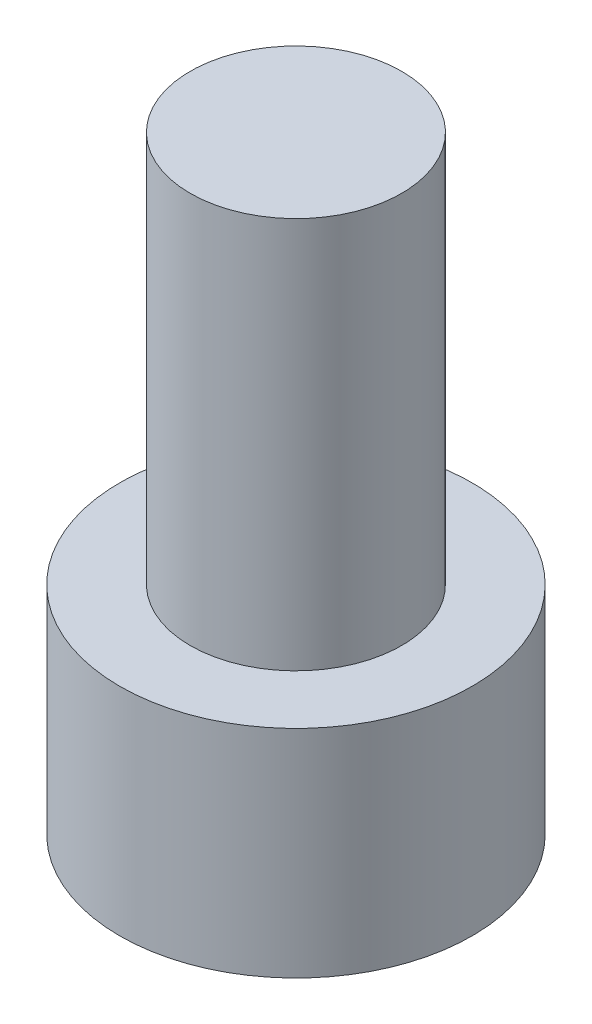
ISO-10303-21;
HEADER;
FILE_DESCRIPTION(('STEP AP214'),'2;1');
FILE_NAME('part.step','',(''),(''),'','','');
FILE_SCHEMA(('AUTOMOTIVE_DESIGN { 1 0 10303 214 1 1 1 1 }'));
ENDSEC;
DATA;
#1=APPLICATION_CONTEXT('core data for automotive mechanical design processes');
#2=APPLICATION_PROTOCOL_DEFINITION('international standard','automotive_design',2000,#1);
#3=PRODUCT_CONTEXT('',#1,'mechanical');
#4=PRODUCT('Part','Part','',(#3));
#5=PRODUCT_RELATED_PRODUCT_CATEGORY('part','',(#4));
#6=PRODUCT_DEFINITION_FORMATION('','',#4);
#7=PRODUCT_DEFINITION_CONTEXT('part definition',#1,'design');
#8=PRODUCT_DEFINITION('design','',#6,#7);
#9=PRODUCT_DEFINITION_SHAPE('','',#8);
#10=(LENGTH_UNIT() NAMED_UNIT(*) SI_UNIT(.MILLI.,.METRE.));
#11=(NAMED_UNIT(*) PLANE_ANGLE_UNIT() SI_UNIT($,.RADIAN.));
#12=(NAMED_UNIT(*) SI_UNIT($,.STERADIAN.) SOLID_ANGLE_UNIT());
#13=UNCERTAINTY_MEASURE_WITH_UNIT(LENGTH_MEASURE(1.E-05),#10,'distance_accuracy_value','');
#14=(GEOMETRIC_REPRESENTATION_CONTEXT(3) GLOBAL_UNCERTAINTY_ASSIGNED_CONTEXT((#13)) GLOBAL_UNIT_ASSIGNED_CONTEXT((#10,
#11,#12)) REPRESENTATION_CONTEXT('',''));
#15=CARTESIAN_POINT('',(0.,0.,0.));
#16=DIRECTION('',(0.,0.,1.));
#17=DIRECTION('',(1.,0.,0.));
#18=AXIS2_PLACEMENT_3D('',#15,#16,#17);
#19=CARTESIAN_POINT('',(0.,3.5052,0.));
#20=DIRECTION('',(0.,1.,0.));
#21=DIRECTION('',(0.,0.,1.));
#22=AXIS2_PLACEMENT_3D('',#19,#20,#21);
#23=PLANE('',#22);
#24=CARTESIAN_POINT('',(0.,3.5052,0.));
#25=DIRECTION('',(0.,1.,0.));
#26=DIRECTION('',(0.,0.,1.));
#27=AXIS2_PLACEMENT_3D('',#24,#25,#26);
#28=CIRCLE('',#27,2.8575);
#29=CARTESIAN_POINT('',(0.,3.5052,2.8575));
#30=VERTEX_POINT('',#29);
#31=EDGE_CURVE('E11',#30,#30,#28,.T.);
#32=ORIENTED_EDGE('',*,*,#31,.T.);
#33=EDGE_LOOP('',(#32));
#34=FACE_BOUND('',#33,.T.);
#35=CARTESIAN_POINT('',(0.,3.5052,0.));
#36=DIRECTION('',(0.,1.,0.));
#37=DIRECTION('',(0.,0.,1.));
#38=AXIS2_PLACEMENT_3D('',#35,#36,#37);
#39=CIRCLE('',#38,1.7145);
#40=CARTESIAN_POINT('',(0.,3.5052,1.7145));
#41=VERTEX_POINT('',#40);
#42=EDGE_CURVE('E152',#41,#41,#39,.T.);
#43=ORIENTED_EDGE('',*,*,#42,.F.);
#44=EDGE_LOOP('',(#43));
#45=FACE_BOUND('',#44,.T.);
#46=ADVANCED_FACE('F33',(#34,#45),#23,.T.);
#47=CARTESIAN_POINT('',(0.,3.5052,0.));
#48=DIRECTION('',(0.,-1.,0.));
#49=DIRECTION('',(0.,0.,-1.));
#50=AXIS2_PLACEMENT_3D('',#47,#48,#49);
#51=CYLINDRICAL_SURFACE('',#50,2.8575);
#52=ORIENTED_EDGE('',*,*,#31,.F.);
#53=EDGE_LOOP('',(#52));
#54=FACE_BOUND('',#53,.T.);
#55=CARTESIAN_POINT('',(0.,0.,0.));
#56=DIRECTION('',(0.,1.,0.));
#57=DIRECTION('',(0.,0.,1.));
#58=AXIS2_PLACEMENT_3D('',#55,#56,#57);
#59=CIRCLE('',#58,2.8575);
#60=CARTESIAN_POINT('',(0.,0.,2.8575));
#61=VERTEX_POINT('',#60);
#62=EDGE_CURVE('E37',#61,#61,#59,.T.);
#63=ORIENTED_EDGE('',*,*,#62,.T.);
#64=EDGE_LOOP('',(#63));
#65=FACE_BOUND('',#64,.T.);
#66=ADVANCED_FACE('F35',(#54,#65),#51,.T.);
#67=CARTESIAN_POINT('',(0.,0.,0.));
#68=DIRECTION('',(0.,1.,0.));
#69=DIRECTION('',(0.,0.,1.));
#70=AXIS2_PLACEMENT_3D('',#67,#68,#69);
#71=PLANE('',#70);
#72=DIRECTION('',(-0.500000000000001,0.,0.866025403784438));
#73=VECTOR('',#72,1.);
#74=CARTESIAN_POINT('',(1.60395121659243,0.,0.));
#75=LINE('',#74,#73);
#76=CARTESIAN_POINT('',(1.60395121659243,0.,0.));
#77=VERTEX_POINT('',#76);
#78=CARTESIAN_POINT('',(0.801975608296214,0.,1.3890625));
#79=VERTEX_POINT('',#78);
#80=EDGE_CURVE('E122',#77,#79,#75,.T.);
#81=ORIENTED_EDGE('',*,*,#80,.F.);
#82=DIRECTION('',(0.5,0.,0.866025403784439));
#83=VECTOR('',#82,1.);
#84=CARTESIAN_POINT('',(0.801975608296215,0.,-1.3890625));
#85=LINE('',#84,#83);
#86=CARTESIAN_POINT('',(0.801975608296215,0.,-1.3890625));
#87=VERTEX_POINT('',#86);
#88=EDGE_CURVE('E48',#87,#77,#85,.T.);
#89=ORIENTED_EDGE('',*,*,#88,.F.);
#90=DIRECTION('',(1.,0.,0.));
#91=VECTOR('',#90,1.);
#92=CARTESIAN_POINT('',(-0.801975608296214,0.,-1.3890625));
#93=LINE('',#92,#91);
#94=CARTESIAN_POINT('',(-0.801975608296214,0.,-1.3890625));
#95=VERTEX_POINT('',#94);
#96=EDGE_CURVE('E132',#95,#87,#93,.T.);
#97=ORIENTED_EDGE('',*,*,#96,.F.);
#98=DIRECTION('',(0.5,0.,-0.866025403784438));
#99=VECTOR('',#98,1.);
#100=CARTESIAN_POINT('',(-1.60395121659243,0.,0.));
#101=LINE('',#100,#99);
#102=CARTESIAN_POINT('',(-1.60395121659243,0.,0.));
#103=VERTEX_POINT('',#102);
#104=EDGE_CURVE('E130',#103,#95,#101,.T.);
#105=ORIENTED_EDGE('',*,*,#104,.F.);
#106=DIRECTION('',(-0.5,0.,-0.866025403784439));
#107=VECTOR('',#106,1.);
#108=CARTESIAN_POINT('',(-0.801975608296214,0.,1.3890625));
#109=LINE('',#108,#107);
#110=CARTESIAN_POINT('',(-0.801975608296214,0.,1.3890625));
#111=VERTEX_POINT('',#110);
#112=EDGE_CURVE('E96',#111,#103,#109,.T.);
#113=ORIENTED_EDGE('',*,*,#112,.F.);
#114=DIRECTION('',(-1.,0.,0.));
#115=VECTOR('',#114,1.);
#116=CARTESIAN_POINT('',(0.801975608296214,0.,1.3890625));
#117=LINE('',#116,#115);
#118=EDGE_CURVE('E126',#79,#111,#117,.T.);
#119=ORIENTED_EDGE('',*,*,#118,.F.);
#120=EDGE_LOOP('',(#81,#89,#97,#105,#113,#119));
#121=FACE_BOUND('',#120,.T.);
#122=ORIENTED_EDGE('',*,*,#62,.F.);
#123=EDGE_LOOP('',(#122));
#124=FACE_BOUND('',#123,.T.);
#125=ADVANCED_FACE('F145',(#121,#124),#71,.F.);
#126=CARTESIAN_POINT('',(0.801975608296215,1.9558,-1.3890625));
#127=DIRECTION('',(0.866025403784438,0.,-0.5));
#128=DIRECTION('',(-0.5,0.,-0.866025403784439));
#129=AXIS2_PLACEMENT_3D('',#126,#127,#128);
#130=PLANE('',#129);
#131=ORIENTED_EDGE('',*,*,#88,.T.);
#132=DIRECTION('',(0.,-1.,0.));
#133=VECTOR('',#132,1.);
#134=CARTESIAN_POINT('',(1.60395121659243,1.9558,0.));
#135=LINE('',#134,#133);
#136=CARTESIAN_POINT('',(1.60395121659243,1.9558,0.));
#137=VERTEX_POINT('',#136);
#138=EDGE_CURVE('E78',#137,#77,#135,.T.);
#139=ORIENTED_EDGE('',*,*,#138,.F.);
#140=DIRECTION('',(0.5,0.,0.866025403784439));
#141=VECTOR('',#140,1.);
#142=CARTESIAN_POINT('',(0.801975608296215,1.9558,-1.3890625));
#143=LINE('',#142,#141);
#144=CARTESIAN_POINT('',(0.801975608296215,1.9558,-1.3890625));
#145=VERTEX_POINT('',#144);
#146=EDGE_CURVE('E134',#145,#137,#143,.T.);
#147=ORIENTED_EDGE('',*,*,#146,.F.);
#148=DIRECTION('',(0.,-1.,0.));
#149=VECTOR('',#148,1.);
#150=CARTESIAN_POINT('',(0.801975608296215,1.9558,-1.3890625));
#151=LINE('',#150,#149);
#152=EDGE_CURVE('E56',#145,#87,#151,.T.);
#153=ORIENTED_EDGE('',*,*,#152,.T.);
#154=EDGE_LOOP('',(#131,#139,#147,#153));
#155=FACE_BOUND('',#154,.T.);
#156=ADVANCED_FACE('F174',(#155),#130,.F.);
#157=CARTESIAN_POINT('',(-0.801975608296214,1.9558,-1.3890625));
#158=DIRECTION('',(0.,0.,-1.));
#159=DIRECTION('',(-1.,0.,0.));
#160=AXIS2_PLACEMENT_3D('',#157,#158,#159);
#161=PLANE('',#160);
#162=ORIENTED_EDGE('',*,*,#96,.T.);
#163=ORIENTED_EDGE('',*,*,#152,.F.);
#164=DIRECTION('',(1.,0.,0.));
#165=VECTOR('',#164,1.);
#166=CARTESIAN_POINT('',(-0.801975608296214,1.9558,-1.3890625));
#167=LINE('',#166,#165);
#168=CARTESIAN_POINT('',(-0.801975608296214,1.9558,-1.3890625));
#169=VERTEX_POINT('',#168);
#170=EDGE_CURVE('E108',#169,#145,#167,.T.);
#171=ORIENTED_EDGE('',*,*,#170,.F.);
#172=DIRECTION('',(0.,-1.,0.));
#173=VECTOR('',#172,1.);
#174=CARTESIAN_POINT('',(-0.801975608296214,1.9558,-1.3890625));
#175=LINE('',#174,#173);
#176=EDGE_CURVE('E100',#169,#95,#175,.T.);
#177=ORIENTED_EDGE('',*,*,#176,.T.);
#178=EDGE_LOOP('',(#162,#163,#171,#177));
#179=FACE_BOUND('',#178,.T.);
#180=ADVANCED_FACE('F180',(#179),#161,.F.);
#181=CARTESIAN_POINT('',(-1.60395121659243,1.9558,0.));
#182=DIRECTION('',(-0.866025403784438,0.,-0.5));
#183=DIRECTION('',(-0.5,0.,0.866025403784439));
#184=AXIS2_PLACEMENT_3D('',#181,#182,#183);
#185=PLANE('',#184);
#186=ORIENTED_EDGE('',*,*,#104,.T.);
#187=ORIENTED_EDGE('',*,*,#176,.F.);
#188=DIRECTION('',(0.5,0.,-0.866025403784438));
#189=VECTOR('',#188,1.);
#190=CARTESIAN_POINT('',(-1.60395121659243,1.9558,0.));
#191=LINE('',#190,#189);
#192=CARTESIAN_POINT('',(-1.60395121659243,1.9558,0.));
#193=VERTEX_POINT('',#192);
#194=EDGE_CURVE('E104',#193,#169,#191,.T.);
#195=ORIENTED_EDGE('',*,*,#194,.F.);
#196=DIRECTION('',(0.,-1.,0.));
#197=VECTOR('',#196,1.);
#198=CARTESIAN_POINT('',(-1.60395121659243,1.9558,0.));
#199=LINE('',#198,#197);
#200=EDGE_CURVE('E89',#193,#103,#199,.T.);
#201=ORIENTED_EDGE('',*,*,#200,.T.);
#202=EDGE_LOOP('',(#186,#187,#195,#201));
#203=FACE_BOUND('',#202,.T.);
#204=ADVANCED_FACE('F105',(#203),#185,.F.);
#205=CARTESIAN_POINT('',(-0.801975608296214,1.9558,1.3890625));
#206=DIRECTION('',(-0.866025403784439,0.,0.5));
#207=DIRECTION('',(0.5,0.,0.866025403784439));
#208=AXIS2_PLACEMENT_3D('',#205,#206,#207);
#209=PLANE('',#208);
#210=ORIENTED_EDGE('',*,*,#112,.T.);
#211=ORIENTED_EDGE('',*,*,#200,.F.);
#212=DIRECTION('',(-0.5,0.,-0.866025403784439));
#213=VECTOR('',#212,1.);
#214=CARTESIAN_POINT('',(-0.801975608296214,1.9558,1.3890625));
#215=LINE('',#214,#213);
#216=CARTESIAN_POINT('',(-0.801975608296214,1.9558,1.3890625));
#217=VERTEX_POINT('',#216);
#218=EDGE_CURVE('E93',#217,#193,#215,.T.);
#219=ORIENTED_EDGE('',*,*,#218,.F.);
#220=DIRECTION('',(0.,-1.,0.));
#221=VECTOR('',#220,1.);
#222=CARTESIAN_POINT('',(-0.801975608296214,1.9558,1.3890625));
#223=LINE('',#222,#221);
#224=EDGE_CURVE('E101',#217,#111,#223,.T.);
#225=ORIENTED_EDGE('',*,*,#224,.T.);
#226=EDGE_LOOP('',(#210,#211,#219,#225));
#227=FACE_BOUND('',#226,.T.);
#228=ADVANCED_FACE('F91',(#227),#209,.F.);
#229=CARTESIAN_POINT('',(0.801975608296214,1.9558,1.3890625));
#230=DIRECTION('',(0.,0.,1.));
#231=DIRECTION('',(1.,0.,0.));
#232=AXIS2_PLACEMENT_3D('',#229,#230,#231);
#233=PLANE('',#232);
#234=ORIENTED_EDGE('',*,*,#118,.T.);
#235=ORIENTED_EDGE('',*,*,#224,.F.);
#236=DIRECTION('',(-1.,0.,0.));
#237=VECTOR('',#236,1.);
#238=CARTESIAN_POINT('',(0.801975608296214,1.9558,1.3890625));
#239=LINE('',#238,#237);
#240=CARTESIAN_POINT('',(0.801975608296214,1.9558,1.3890625));
#241=VERTEX_POINT('',#240);
#242=EDGE_CURVE('E114',#241,#217,#239,.T.);
#243=ORIENTED_EDGE('',*,*,#242,.F.);
#244=DIRECTION('',(0.,-1.,0.));
#245=VECTOR('',#244,1.);
#246=CARTESIAN_POINT('',(0.801975608296214,1.9558,1.3890625));
#247=LINE('',#246,#245);
#248=EDGE_CURVE('E138',#241,#79,#247,.T.);
#249=ORIENTED_EDGE('',*,*,#248,.T.);
#250=EDGE_LOOP('',(#234,#235,#243,#249));
#251=FACE_BOUND('',#250,.T.);
#252=ADVANCED_FACE('F149',(#251),#233,.F.);
#253=CARTESIAN_POINT('',(1.60395121659243,1.9558,0.));
#254=DIRECTION('',(0.866025403784438,0.,0.500000000000001));
#255=DIRECTION('',(0.500000000000001,0.,-0.866025403784438));
#256=AXIS2_PLACEMENT_3D('',#253,#254,#255);
#257=PLANE('',#256);
#258=ORIENTED_EDGE('',*,*,#80,.T.);
#259=ORIENTED_EDGE('',*,*,#248,.F.);
#260=DIRECTION('',(-0.500000000000001,0.,0.866025403784438));
#261=VECTOR('',#260,1.);
#262=CARTESIAN_POINT('',(1.60395121659243,1.9558,0.));
#263=LINE('',#262,#261);
#264=EDGE_CURVE('E116',#137,#241,#263,.T.);
#265=ORIENTED_EDGE('',*,*,#264,.F.);
#266=ORIENTED_EDGE('',*,*,#138,.T.);
#267=EDGE_LOOP('',(#258,#259,#265,#266));
#268=FACE_BOUND('',#267,.T.);
#269=ADVANCED_FACE('F142',(#268),#257,.F.);
#270=CARTESIAN_POINT('',(0.,1.9558,0.));
#271=DIRECTION('',(0.,-1.,0.));
#272=DIRECTION('',(0.,0.,-1.));
#273=AXIS2_PLACEMENT_3D('',#270,#271,#272);
#274=PLANE('',#273);
#275=ORIENTED_EDGE('',*,*,#146,.T.);
#276=ORIENTED_EDGE('',*,*,#264,.T.);
#277=ORIENTED_EDGE('',*,*,#242,.T.);
#278=ORIENTED_EDGE('',*,*,#218,.T.);
#279=ORIENTED_EDGE('',*,*,#194,.T.);
#280=ORIENTED_EDGE('',*,*,#170,.T.);
#281=EDGE_LOOP('',(#275,#276,#277,#278,#279,#280));
#282=FACE_BOUND('',#281,.T.);
#283=ADVANCED_FACE('F111',(#282),#274,.T.);
#284=CARTESIAN_POINT('',(0.,9.8552,0.));
#285=DIRECTION('',(0.,-1.,0.));
#286=DIRECTION('',(0.,0.,-1.));
#287=AXIS2_PLACEMENT_3D('',#284,#285,#286);
#288=CYLINDRICAL_SURFACE('',#287,1.7145);
#289=CARTESIAN_POINT('',(0.,9.8552,0.));
#290=DIRECTION('',(0.,1.,0.));
#291=DIRECTION('',(0.,0.,1.));
#292=AXIS2_PLACEMENT_3D('',#289,#290,#291);
#293=CIRCLE('',#292,1.7145);
#294=CARTESIAN_POINT('',(0.,9.8552,1.7145));
#295=VERTEX_POINT('',#294);
#296=EDGE_CURVE('E123',#295,#295,#293,.T.);
#297=ORIENTED_EDGE('',*,*,#296,.F.);
#298=EDGE_LOOP('',(#297));
#299=FACE_BOUND('',#298,.T.);
#300=ORIENTED_EDGE('',*,*,#42,.T.);
#301=EDGE_LOOP('',(#300));
#302=FACE_BOUND('',#301,.T.);
#303=ADVANCED_FACE('F160',(#299,#302),#288,.T.);
#304=CARTESIAN_POINT('',(0.,9.8552,0.));
#305=DIRECTION('',(0.,1.,0.));
#306=DIRECTION('',(0.,0.,1.));
#307=AXIS2_PLACEMENT_3D('',#304,#305,#306);
#308=PLANE('',#307);
#309=ORIENTED_EDGE('',*,*,#296,.T.);
#310=EDGE_LOOP('',(#309));
#311=FACE_BOUND('',#310,.T.);
#312=ADVANCED_FACE('F158',(#311),#308,.T.);
#313=CLOSED_SHELL('',(#46,#66,#125,#156,#180,#204,#228,#252,#269,#283,#303,#312));
#314=MANIFOLD_SOLID_BREP('B2',#313);
#315=ADVANCED_BREP_SHAPE_REPRESENTATION('',(#18,#314),#14);
#316=SHAPE_DEFINITION_REPRESENTATION(#9,#315);
ENDSEC;
END-ISO-10303-21;
